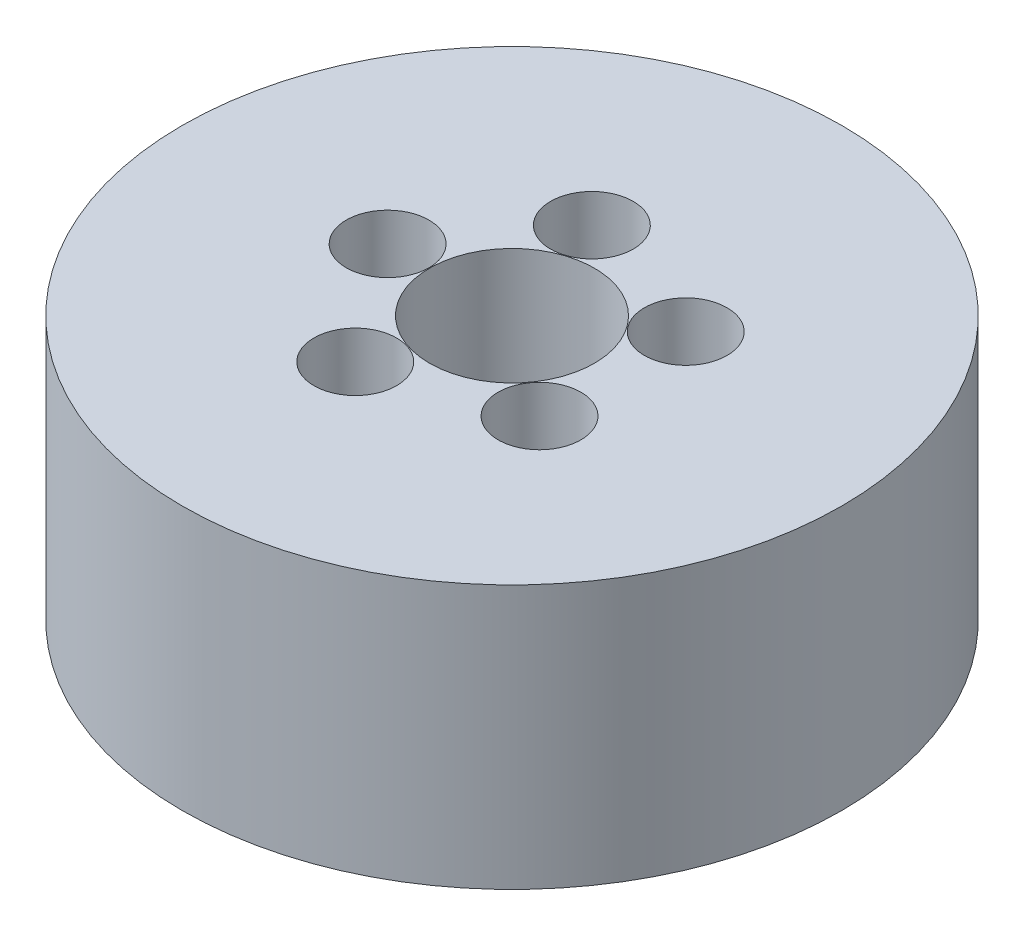
ISO-10303-21;
HEADER;
FILE_DESCRIPTION(('STEP AP214'),'2;1');
FILE_NAME('part.step','',(''),(''),'','','');
FILE_SCHEMA(('AUTOMOTIVE_DESIGN { 1 0 10303 214 1 1 1 1 }'));
ENDSEC;
DATA;
#1=APPLICATION_CONTEXT('core data for automotive mechanical design processes');
#2=APPLICATION_PROTOCOL_DEFINITION('international standard','automotive_design',2000,#1);
#3=PRODUCT_CONTEXT('',#1,'mechanical');
#4=PRODUCT('Part','Part','',(#3));
#5=PRODUCT_RELATED_PRODUCT_CATEGORY('part','',(#4));
#6=PRODUCT_DEFINITION_FORMATION('','',#4);
#7=PRODUCT_DEFINITION_CONTEXT('part definition',#1,'design');
#8=PRODUCT_DEFINITION('design','',#6,#7);
#9=PRODUCT_DEFINITION_SHAPE('','',#8);
#10=(LENGTH_UNIT() NAMED_UNIT(*) SI_UNIT(.MILLI.,.METRE.));
#11=(NAMED_UNIT(*) PLANE_ANGLE_UNIT() SI_UNIT($,.RADIAN.));
#12=(NAMED_UNIT(*) SI_UNIT($,.STERADIAN.) SOLID_ANGLE_UNIT());
#13=UNCERTAINTY_MEASURE_WITH_UNIT(LENGTH_MEASURE(1.E-05),#10,'distance_accuracy_value','');
#14=(GEOMETRIC_REPRESENTATION_CONTEXT(3) GLOBAL_UNCERTAINTY_ASSIGNED_CONTEXT((#13)) GLOBAL_UNIT_ASSIGNED_CONTEXT((#10,
#11,#12)) REPRESENTATION_CONTEXT('',''));
#15=CARTESIAN_POINT('',(0.,0.,0.));
#16=DIRECTION('',(0.,0.,1.));
#17=DIRECTION('',(1.,0.,0.));
#18=AXIS2_PLACEMENT_3D('',#15,#16,#17);
#19=CARTESIAN_POINT('',(0.,16.,0.));
#20=DIRECTION('',(0.,-1.,0.));
#21=DIRECTION('',(0.,0.,-1.));
#22=AXIS2_PLACEMENT_3D('',#19,#20,#21);
#23=CYLINDRICAL_SURFACE('',#22,20.);
#24=CARTESIAN_POINT('',(0.,16.,0.));
#25=DIRECTION('',(0.,1.,0.));
#26=DIRECTION('',(0.,0.,1.));
#27=AXIS2_PLACEMENT_3D('',#24,#25,#26);
#28=CIRCLE('',#27,20.);
#29=CARTESIAN_POINT('',(0.,16.,20.));
#30=VERTEX_POINT('',#29);
#31=EDGE_CURVE('E10',#30,#30,#28,.T.);
#32=ORIENTED_EDGE('',*,*,#31,.F.);
#33=EDGE_LOOP('',(#32));
#34=FACE_BOUND('',#33,.T.);
#35=CARTESIAN_POINT('',(0.,0.,0.));
#36=DIRECTION('',(0.,1.,0.));
#37=DIRECTION('',(0.,0.,1.));
#38=AXIS2_PLACEMENT_3D('',#35,#36,#37);
#39=CIRCLE('',#38,20.);
#40=CARTESIAN_POINT('',(0.,0.,20.));
#41=VERTEX_POINT('',#40);
#42=EDGE_CURVE('E37',#41,#41,#39,.T.);
#43=ORIENTED_EDGE('',*,*,#42,.T.);
#44=EDGE_LOOP('',(#43));
#45=FACE_BOUND('',#44,.T.);
#46=ADVANCED_FACE('F40',(#34,#45),#23,.T.);
#47=CARTESIAN_POINT('',(0.,16.,0.));
#48=DIRECTION('',(0.,1.,0.));
#49=DIRECTION('',(0.,0.,1.));
#50=AXIS2_PLACEMENT_3D('',#47,#48,#49);
#51=PLANE('',#50);
#52=CARTESIAN_POINT('',(-2.33176008511596,16.,-7.17641962660348));
#53=DIRECTION('',(0.,1.,0.));
#54=DIRECTION('',(-0.95105651629515,0.,0.309016994374958));
#55=AXIS2_PLACEMENT_3D('',#52,#53,#54);
#56=CIRCLE('',#55,2.50867482875243);
#57=CARTESIAN_POINT('',(-4.71765162826658,16.,-6.4011964711583));
#58=VERTEX_POINT('',#57);
#59=EDGE_CURVE('E70',#58,#58,#56,.T.);
#60=ORIENTED_EDGE('',*,*,#59,.F.);
#61=EDGE_LOOP('',(#60));
#62=FACE_BOUND('',#61,.T.);
#63=CARTESIAN_POINT('',(6.10462715644368,16.,-4.43527124677285));
#64=DIRECTION('',(0.,1.,0.));
#65=DIRECTION('',(-0.58778525229248,0.,-0.809016994374942));
#66=AXIS2_PLACEMENT_3D('',#63,#64,#65);
#67=CIRCLE('',#66,2.50867482875243);
#68=CARTESIAN_POINT('',(4.63006508930564,16.,-6.46483181659421));
#69=VERTEX_POINT('',#68);
#70=EDGE_CURVE('E71',#69,#69,#67,.T.);
#71=ORIENTED_EDGE('',*,*,#70,.F.);
#72=EDGE_LOOP('',(#71));
#73=FACE_BOUND('',#72,.T.);
#74=CARTESIAN_POINT('',(6.10462715644375,16.,4.43527124677277));
#75=DIRECTION('',(0.,1.,0.));
#76=DIRECTION('',(0.587785252292469,0.,-0.809016994374951));
#77=AXIS2_PLACEMENT_3D('',#74,#75,#76);
#78=CIRCLE('',#77,2.50867482875243);
#79=CARTESIAN_POINT('',(7.57918922358176,16.,2.40571067695138));
#80=VERTEX_POINT('',#79);
#81=EDGE_CURVE('E78',#80,#80,#78,.T.);
#82=ORIENTED_EDGE('',*,*,#81,.F.);
#83=EDGE_LOOP('',(#82));
#84=FACE_BOUND('',#83,.T.);
#85=CARTESIAN_POINT('',(-2.33176008511586,16.,7.17641962660352));
#86=DIRECTION('',(0.,1.,0.));
#87=DIRECTION('',(0.951056516295155,0.,0.309016994374945));
#88=AXIS2_PLACEMENT_3D('',#85,#86,#87);
#89=CIRCLE('',#88,2.50867482875243);
#90=CARTESIAN_POINT('',(0.0541314580347679,16.,7.95164278204867));
#91=VERTEX_POINT('',#90);
#92=EDGE_CURVE('E61',#91,#91,#89,.T.);
#93=ORIENTED_EDGE('',*,*,#92,.F.);
#94=EDGE_LOOP('',(#93));
#95=FACE_BOUND('',#94,.T.);
#96=CARTESIAN_POINT('',(-7.54573414265568,16.,0.));
#97=DIRECTION('',(0.,1.,0.));
#98=DIRECTION('',(0.,0.,1.));
#99=AXIS2_PLACEMENT_3D('',#96,#97,#98);
#100=CIRCLE('',#99,2.50867482875243);
#101=CARTESIAN_POINT('',(-7.54573414265568,16.,2.50867482875243));
#102=VERTEX_POINT('',#101);
#103=EDGE_CURVE('E54',#102,#102,#100,.T.);
#104=ORIENTED_EDGE('',*,*,#103,.F.);
#105=EDGE_LOOP('',(#104));
#106=FACE_BOUND('',#105,.T.);
#107=CARTESIAN_POINT('',(0.,16.,0.));
#108=DIRECTION('',(0.,1.,0.));
#109=DIRECTION('',(0.,0.,1.));
#110=AXIS2_PLACEMENT_3D('',#107,#108,#109);
#111=CIRCLE('',#110,5.);
#112=CARTESIAN_POINT('',(0.,16.,5.));
#113=VERTEX_POINT('',#112);
#114=EDGE_CURVE('E50',#113,#113,#111,.T.);
#115=ORIENTED_EDGE('',*,*,#114,.F.);
#116=EDGE_LOOP('',(#115));
#117=FACE_BOUND('',#116,.T.);
#118=ORIENTED_EDGE('',*,*,#31,.T.);
#119=EDGE_LOOP('',(#118));
#120=FACE_BOUND('',#119,.T.);
#121=ADVANCED_FACE('F94',(#62,#73,#84,#95,#106,#117,#120),#51,.T.);
#122=CARTESIAN_POINT('',(0.,0.,0.));
#123=DIRECTION('',(0.,1.,0.));
#124=DIRECTION('',(0.,0.,1.));
#125=AXIS2_PLACEMENT_3D('',#122,#123,#124);
#126=PLANE('',#125);
#127=CARTESIAN_POINT('',(0.,0.,0.));
#128=DIRECTION('',(0.,1.,0.));
#129=DIRECTION('',(0.,0.,1.));
#130=AXIS2_PLACEMENT_3D('',#127,#128,#129);
#131=CIRCLE('',#130,5.);
#132=CARTESIAN_POINT('',(0.,0.,5.));
#133=VERTEX_POINT('',#132);
#134=EDGE_CURVE('E47',#133,#133,#131,.T.);
#135=ORIENTED_EDGE('',*,*,#134,.T.);
#136=EDGE_LOOP('',(#135));
#137=FACE_BOUND('',#136,.T.);
#138=ORIENTED_EDGE('',*,*,#42,.F.);
#139=EDGE_LOOP('',(#138));
#140=FACE_BOUND('',#139,.T.);
#141=ADVANCED_FACE('F100',(#137,#140),#126,.F.);
#142=CARTESIAN_POINT('',(0.,16.,0.));
#143=DIRECTION('',(0.,-1.,0.));
#144=DIRECTION('',(0.,0.,-1.));
#145=AXIS2_PLACEMENT_3D('',#142,#143,#144);
#146=CYLINDRICAL_SURFACE('',#145,5.);
#147=ORIENTED_EDGE('',*,*,#114,.T.);
#148=EDGE_LOOP('',(#147));
#149=FACE_BOUND('',#148,.T.);
#150=ORIENTED_EDGE('',*,*,#134,.F.);
#151=EDGE_LOOP('',(#150));
#152=FACE_BOUND('',#151,.T.);
#153=ADVANCED_FACE('F106',(#149,#152),#146,.F.);
#154=CARTESIAN_POINT('',(-7.54573414265568,3.84358116515495,0.));
#155=DIRECTION('',(0.,1.,0.));
#156=DIRECTION('',(0.,0.,1.));
#157=AXIS2_PLACEMENT_3D('',#154,#155,#156);
#158=CYLINDRICAL_SURFACE('',#157,2.50867482875243);
#159=CARTESIAN_POINT('',(-7.54573414265568,3.84358116515495,0.));
#160=DIRECTION('',(0.,1.,0.));
#161=DIRECTION('',(0.,0.,1.));
#162=AXIS2_PLACEMENT_3D('',#159,#160,#161);
#163=CIRCLE('',#162,2.50867482875243);
#164=CARTESIAN_POINT('',(-7.54573414265568,3.84358116515495,2.50867482875243));
#165=VERTEX_POINT('',#164);
#166=EDGE_CURVE('E55',#165,#165,#163,.T.);
#167=ORIENTED_EDGE('',*,*,#166,.F.);
#168=EDGE_LOOP('',(#167));
#169=FACE_BOUND('',#168,.T.);
#170=ORIENTED_EDGE('',*,*,#103,.T.);
#171=EDGE_LOOP('',(#170));
#172=FACE_BOUND('',#171,.T.);
#173=ADVANCED_FACE('F108',(#169,#172),#158,.F.);
#174=CARTESIAN_POINT('',(-7.54573414265568,3.84358116515495,0.));
#175=DIRECTION('',(0.,1.,0.));
#176=DIRECTION('',(0.,0.,1.));
#177=AXIS2_PLACEMENT_3D('',#174,#175,#176);
#178=PLANE('',#177);
#179=ORIENTED_EDGE('',*,*,#166,.T.);
#180=EDGE_LOOP('',(#179));
#181=FACE_BOUND('',#180,.T.);
#182=ADVANCED_FACE('F138',(#181),#178,.T.);
#183=CARTESIAN_POINT('',(-2.33176008511586,3.84358116515495,7.17641962660352));
#184=DIRECTION('',(0.,1.,0.));
#185=DIRECTION('',(0.,0.,1.));
#186=AXIS2_PLACEMENT_3D('',#183,#184,#185);
#187=CYLINDRICAL_SURFACE('',#186,2.50867482875243);
#188=CARTESIAN_POINT('',(-2.33176008511586,3.84358116515495,7.17641962660352));
#189=DIRECTION('',(0.,1.,0.));
#190=DIRECTION('',(0.951056516295155,0.,0.309016994374945));
#191=AXIS2_PLACEMENT_3D('',#188,#189,#190);
#192=CIRCLE('',#191,2.50867482875243);
#193=CARTESIAN_POINT('',(0.0541314580347679,3.84358116515495,7.95164278204867));
#194=VERTEX_POINT('',#193);
#195=EDGE_CURVE('E59',#194,#194,#192,.T.);
#196=ORIENTED_EDGE('',*,*,#195,.F.);
#197=EDGE_LOOP('',(#196));
#198=FACE_BOUND('',#197,.T.);
#199=ORIENTED_EDGE('',*,*,#92,.T.);
#200=EDGE_LOOP('',(#199));
#201=FACE_BOUND('',#200,.T.);
#202=ADVANCED_FACE('F150',(#198,#201),#187,.F.);
#203=CARTESIAN_POINT('',(-2.33176008511586,3.84358116515495,7.17641962660352));
#204=DIRECTION('',(0.,1.,0.));
#205=DIRECTION('',(0.951056516295155,0.,0.309016994374945));
#206=AXIS2_PLACEMENT_3D('',#203,#204,#205);
#207=PLANE('',#206);
#208=ORIENTED_EDGE('',*,*,#195,.T.);
#209=EDGE_LOOP('',(#208));
#210=FACE_BOUND('',#209,.T.);
#211=ADVANCED_FACE('F89',(#210),#207,.T.);
#212=CARTESIAN_POINT('',(6.10462715644375,3.84358116515495,4.43527124677277));
#213=DIRECTION('',(0.,1.,0.));
#214=DIRECTION('',(0.,0.,1.));
#215=AXIS2_PLACEMENT_3D('',#212,#213,#214);
#216=CYLINDRICAL_SURFACE('',#215,2.50867482875243);
#217=CARTESIAN_POINT('',(6.10462715644375,3.84358116515495,4.43527124677277));
#218=DIRECTION('',(0.,1.,0.));
#219=DIRECTION('',(0.587785252292469,0.,-0.809016994374951));
#220=AXIS2_PLACEMENT_3D('',#217,#218,#219);
#221=CIRCLE('',#220,2.50867482875243);
#222=CARTESIAN_POINT('',(7.57918922358176,3.84358116515495,2.40571067695138));
#223=VERTEX_POINT('',#222);
#224=EDGE_CURVE('E63',#223,#223,#221,.T.);
#225=ORIENTED_EDGE('',*,*,#224,.F.);
#226=EDGE_LOOP('',(#225));
#227=FACE_BOUND('',#226,.T.);
#228=ORIENTED_EDGE('',*,*,#81,.T.);
#229=EDGE_LOOP('',(#228));
#230=FACE_BOUND('',#229,.T.);
#231=ADVANCED_FACE('F87',(#227,#230),#216,.F.);
#232=CARTESIAN_POINT('',(6.10462715644375,3.84358116515495,4.43527124677277));
#233=DIRECTION('',(0.,1.,0.));
#234=DIRECTION('',(0.587785252292469,0.,-0.809016994374951));
#235=AXIS2_PLACEMENT_3D('',#232,#233,#234);
#236=PLANE('',#235);
#237=ORIENTED_EDGE('',*,*,#224,.T.);
#238=EDGE_LOOP('',(#237));
#239=FACE_BOUND('',#238,.T.);
#240=ADVANCED_FACE('F84',(#239),#236,.T.);
#241=CARTESIAN_POINT('',(6.10462715644368,3.84358116515495,-4.43527124677285));
#242=DIRECTION('',(0.,1.,0.));
#243=DIRECTION('',(0.,0.,1.));
#244=AXIS2_PLACEMENT_3D('',#241,#242,#243);
#245=CYLINDRICAL_SURFACE('',#244,2.50867482875243);
#246=CARTESIAN_POINT('',(6.10462715644368,3.84358116515495,-4.43527124677285));
#247=DIRECTION('',(0.,1.,0.));
#248=DIRECTION('',(-0.58778525229248,0.,-0.809016994374942));
#249=AXIS2_PLACEMENT_3D('',#246,#247,#248);
#250=CIRCLE('',#249,2.50867482875243);
#251=CARTESIAN_POINT('',(4.63006508930564,3.84358116515495,-6.46483181659421));
#252=VERTEX_POINT('',#251);
#253=EDGE_CURVE('E76',#252,#252,#250,.T.);
#254=ORIENTED_EDGE('',*,*,#253,.F.);
#255=EDGE_LOOP('',(#254));
#256=FACE_BOUND('',#255,.T.);
#257=ORIENTED_EDGE('',*,*,#70,.T.);
#258=EDGE_LOOP('',(#257));
#259=FACE_BOUND('',#258,.T.);
#260=ADVANCED_FACE('F185',(#256,#259),#245,.F.);
#261=CARTESIAN_POINT('',(6.10462715644368,3.84358116515495,-4.43527124677285));
#262=DIRECTION('',(0.,1.,0.));
#263=DIRECTION('',(-0.58778525229248,0.,-0.809016994374942));
#264=AXIS2_PLACEMENT_3D('',#261,#262,#263);
#265=PLANE('',#264);
#266=ORIENTED_EDGE('',*,*,#253,.T.);
#267=EDGE_LOOP('',(#266));
#268=FACE_BOUND('',#267,.T.);
#269=ADVANCED_FACE('F189',(#268),#265,.T.);
#270=CARTESIAN_POINT('',(-2.33176008511596,3.84358116515495,-7.17641962660348));
#271=DIRECTION('',(0.,1.,0.));
#272=DIRECTION('',(0.,0.,1.));
#273=AXIS2_PLACEMENT_3D('',#270,#271,#272);
#274=CYLINDRICAL_SURFACE('',#273,2.50867482875243);
#275=CARTESIAN_POINT('',(-2.33176008511596,3.84358116515495,-7.17641962660348));
#276=DIRECTION('',(0.,1.,0.));
#277=DIRECTION('',(-0.95105651629515,0.,0.309016994374958));
#278=AXIS2_PLACEMENT_3D('',#275,#276,#277);
#279=CIRCLE('',#278,2.50867482875243);
#280=CARTESIAN_POINT('',(-4.71765162826658,3.84358116515495,-6.4011964711583));
#281=VERTEX_POINT('',#280);
#282=EDGE_CURVE('E69',#281,#281,#279,.T.);
#283=ORIENTED_EDGE('',*,*,#282,.F.);
#284=EDGE_LOOP('',(#283));
#285=FACE_BOUND('',#284,.T.);
#286=ORIENTED_EDGE('',*,*,#59,.T.);
#287=EDGE_LOOP('',(#286));
#288=FACE_BOUND('',#287,.T.);
#289=ADVANCED_FACE('F200',(#285,#288),#274,.F.);
#290=CARTESIAN_POINT('',(-2.33176008511596,3.84358116515495,-7.17641962660348));
#291=DIRECTION('',(0.,1.,0.));
#292=DIRECTION('',(-0.95105651629515,0.,0.309016994374958));
#293=AXIS2_PLACEMENT_3D('',#290,#291,#292);
#294=PLANE('',#293);
#295=ORIENTED_EDGE('',*,*,#282,.T.);
#296=EDGE_LOOP('',(#295));
#297=FACE_BOUND('',#296,.T.);
#298=ADVANCED_FACE('F208',(#297),#294,.T.);
#299=CLOSED_SHELL('',(#46,#121,#141,#153,#173,#182,#202,#211,#231,#240,#260,#269,#289,#298));
#300=MANIFOLD_SOLID_BREP('B2',#299);
#301=ADVANCED_BREP_SHAPE_REPRESENTATION('',(#18,#300),#14);
#302=SHAPE_DEFINITION_REPRESENTATION(#9,#301);
ENDSEC;
END-ISO-10303-21;
